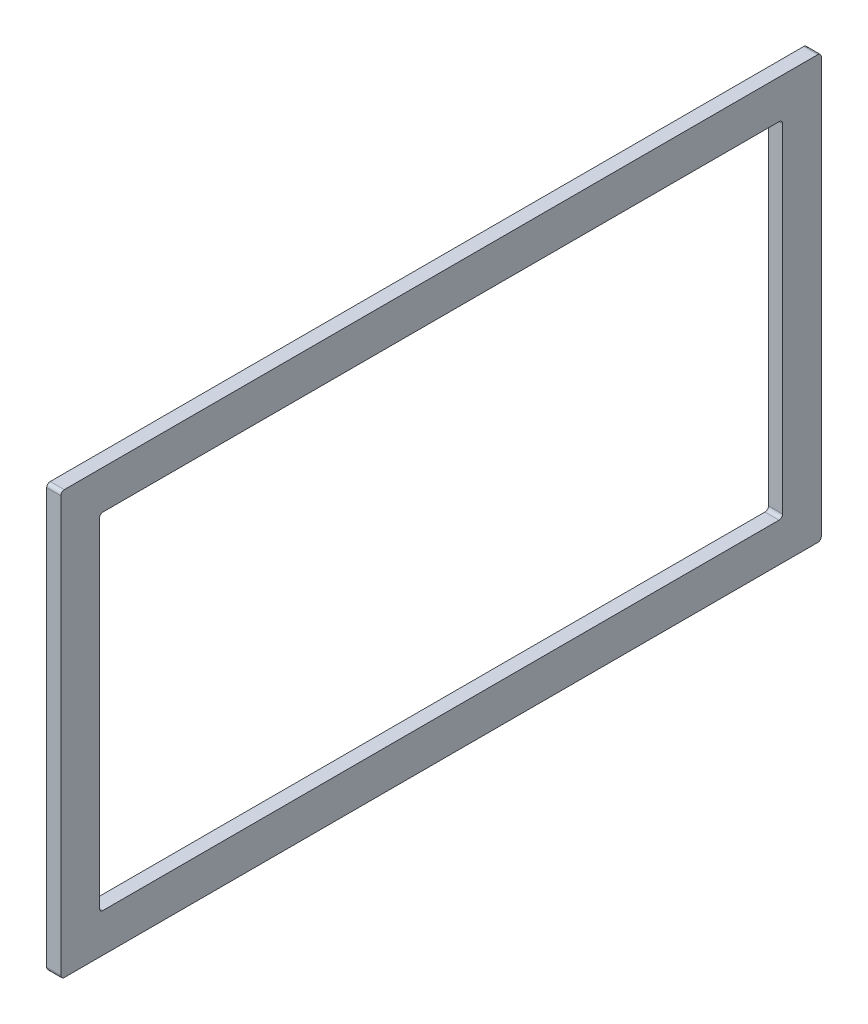
ISO-10303-21;
HEADER;
FILE_DESCRIPTION(('STEP AP214'),'2;1');
FILE_NAME('part.step','',(''),(''),'','','');
FILE_SCHEMA(('AUTOMOTIVE_DESIGN { 1 0 10303 214 1 1 1 1 }'));
ENDSEC;
DATA;
#1=APPLICATION_CONTEXT('core data for automotive mechanical design processes');
#2=APPLICATION_PROTOCOL_DEFINITION('international standard','automotive_design',2000,#1);
#3=PRODUCT_CONTEXT('',#1,'mechanical');
#4=PRODUCT('Part','Part','',(#3));
#5=PRODUCT_RELATED_PRODUCT_CATEGORY('part','',(#4));
#6=PRODUCT_DEFINITION_FORMATION('','',#4);
#7=PRODUCT_DEFINITION_CONTEXT('part definition',#1,'design');
#8=PRODUCT_DEFINITION('design','',#6,#7);
#9=PRODUCT_DEFINITION_SHAPE('','',#8);
#10=(LENGTH_UNIT() NAMED_UNIT(*) SI_UNIT(.MILLI.,.METRE.));
#11=(NAMED_UNIT(*) PLANE_ANGLE_UNIT() SI_UNIT($,.RADIAN.));
#12=(NAMED_UNIT(*) SI_UNIT($,.STERADIAN.) SOLID_ANGLE_UNIT());
#13=UNCERTAINTY_MEASURE_WITH_UNIT(LENGTH_MEASURE(1.E-05),#10,'distance_accuracy_value','');
#14=(GEOMETRIC_REPRESENTATION_CONTEXT(3) GLOBAL_UNCERTAINTY_ASSIGNED_CONTEXT((#13)) GLOBAL_UNIT_ASSIGNED_CONTEXT((#10,
#11,#12)) REPRESENTATION_CONTEXT('',''));
#15=CARTESIAN_POINT('',(0.,0.,0.));
#16=DIRECTION('',(0.,0.,1.));
#17=DIRECTION('',(1.,0.,0.));
#18=AXIS2_PLACEMENT_3D('',#15,#16,#17);
#19=CARTESIAN_POINT('',(-323.849999999993,0.,0.));
#20=DIRECTION('',(-1.,0.,0.));
#21=DIRECTION('',(0.,0.,1.));
#22=AXIS2_PLACEMENT_3D('',#19,#20,#21);
#23=PLANE('',#22);
#24=DIRECTION('',(0.,0.,-1.));
#25=VECTOR('',#24,1.);
#26=CARTESIAN_POINT('',(-323.849999999993,520.7,-342.9));
#27=LINE('',#26,#25);
#28=CARTESIAN_POINT('',(-323.849999999993,520.7,339.725));
#29=VERTEX_POINT('',#28);
#30=CARTESIAN_POINT('',(-323.849999999993,520.7,-339.725));
#31=VERTEX_POINT('',#30);
#32=EDGE_CURVE('E179',#29,#31,#27,.T.);
#33=ORIENTED_EDGE('',*,*,#32,.T.);
#34=CARTESIAN_POINT('',(-323.849999999993,517.525,-339.725));
#35=DIRECTION('',(-1.,0.,0.));
#36=DIRECTION('',(0.,0.,1.));
#37=AXIS2_PLACEMENT_3D('',#34,#35,#36);
#38=CIRCLE('',#37,3.175);
#39=CARTESIAN_POINT('',(-323.849999999993,517.525,-342.9));
#40=VERTEX_POINT('',#39);
#41=EDGE_CURVE('E226',#31,#40,#38,.T.);
#42=ORIENTED_EDGE('',*,*,#41,.T.);
#43=DIRECTION('',(0.,-1.,0.));
#44=VECTOR('',#43,1.);
#45=CARTESIAN_POINT('',(-323.849999999993,520.7,-342.9));
#46=LINE('',#45,#44);
#47=CARTESIAN_POINT('',(-323.849999999993,142.875,-342.9));
#48=VERTEX_POINT('',#47);
#49=EDGE_CURVE('E278',#40,#48,#46,.T.);
#50=ORIENTED_EDGE('',*,*,#49,.T.);
#51=CARTESIAN_POINT('',(-323.849999999993,142.875,-339.725));
#52=DIRECTION('',(-1.,0.,0.));
#53=DIRECTION('',(0.,0.,1.));
#54=AXIS2_PLACEMENT_3D('',#51,#52,#53);
#55=CIRCLE('',#54,3.175);
#56=CARTESIAN_POINT('',(-323.849999999993,139.7,-339.725));
#57=VERTEX_POINT('',#56);
#58=EDGE_CURVE('E221',#48,#57,#55,.T.);
#59=ORIENTED_EDGE('',*,*,#58,.T.);
#60=DIRECTION('',(0.,0.,1.));
#61=VECTOR('',#60,1.);
#62=CARTESIAN_POINT('',(-323.849999999993,139.7,-342.9));
#63=LINE('',#62,#61);
#64=CARTESIAN_POINT('',(-323.849999999993,139.7,339.725));
#65=VERTEX_POINT('',#64);
#66=EDGE_CURVE('E281',#57,#65,#63,.T.);
#67=ORIENTED_EDGE('',*,*,#66,.T.);
#68=CARTESIAN_POINT('',(-323.849999999993,142.875,339.725));
#69=DIRECTION('',(-1.,0.,0.));
#70=DIRECTION('',(0.,0.,1.));
#71=AXIS2_PLACEMENT_3D('',#68,#69,#70);
#72=CIRCLE('',#71,3.175);
#73=CARTESIAN_POINT('',(-323.849999999993,142.875,342.9));
#74=VERTEX_POINT('',#73);
#75=EDGE_CURVE('E61',#65,#74,#72,.T.);
#76=ORIENTED_EDGE('',*,*,#75,.T.);
#77=DIRECTION('',(0.,1.,0.));
#78=VECTOR('',#77,1.);
#79=CARTESIAN_POINT('',(-323.849999999993,520.7,342.9));
#80=LINE('',#79,#78);
#81=CARTESIAN_POINT('',(-323.849999999993,517.525,342.9));
#82=VERTEX_POINT('',#81);
#83=EDGE_CURVE('E184',#74,#82,#80,.T.);
#84=ORIENTED_EDGE('',*,*,#83,.T.);
#85=CARTESIAN_POINT('',(-323.849999999993,517.525,339.725));
#86=DIRECTION('',(-1.,0.,0.));
#87=DIRECTION('',(0.,0.,1.));
#88=AXIS2_PLACEMENT_3D('',#85,#86,#87);
#89=CIRCLE('',#88,3.175);
#90=EDGE_CURVE('E224',#82,#29,#89,.T.);
#91=ORIENTED_EDGE('',*,*,#90,.T.);
#92=EDGE_LOOP('',(#33,#42,#50,#59,#67,#76,#84,#91));
#93=FACE_BOUND('',#92,.T.);
#94=DIRECTION('',(0.,0.,1.));
#95=VECTOR('',#94,1.);
#96=CARTESIAN_POINT('',(-323.849999999993,174.625,-307.975));
#97=LINE('',#96,#95);
#98=CARTESIAN_POINT('',(-323.849999999993,174.625,-304.8));
#99=VERTEX_POINT('',#98);
#100=CARTESIAN_POINT('',(-323.849999999993,174.625,304.8));
#101=VERTEX_POINT('',#100);
#102=EDGE_CURVE('E271',#99,#101,#97,.T.);
#103=ORIENTED_EDGE('',*,*,#102,.F.);
#104=CARTESIAN_POINT('',(-323.849999999993,177.8,-304.8));
#105=DIRECTION('',(-1.,0.,0.));
#106=DIRECTION('',(0.,0.,1.));
#107=AXIS2_PLACEMENT_3D('',#104,#105,#106);
#108=CIRCLE('',#107,3.175);
#109=CARTESIAN_POINT('',(-323.849999999993,177.8,-307.975));
#110=VERTEX_POINT('',#109);
#111=EDGE_CURVE('E164',#99,#110,#108,.F.);
#112=ORIENTED_EDGE('',*,*,#111,.T.);
#113=DIRECTION('',(0.,-1.,0.));
#114=VECTOR('',#113,1.);
#115=CARTESIAN_POINT('',(-323.849999999993,485.775,-307.975));
#116=LINE('',#115,#114);
#117=CARTESIAN_POINT('',(-323.849999999993,482.6,-307.975));
#118=VERTEX_POINT('',#117);
#119=EDGE_CURVE('E260',#118,#110,#116,.T.);
#120=ORIENTED_EDGE('',*,*,#119,.F.);
#121=CARTESIAN_POINT('',(-323.849999999993,482.6,-304.8));
#122=DIRECTION('',(-1.,0.,0.));
#123=DIRECTION('',(0.,0.,1.));
#124=AXIS2_PLACEMENT_3D('',#121,#122,#123);
#125=CIRCLE('',#124,3.175);
#126=CARTESIAN_POINT('',(-323.849999999993,485.775,-304.8));
#127=VERTEX_POINT('',#126);
#128=EDGE_CURVE('E11',#118,#127,#125,.F.);
#129=ORIENTED_EDGE('',*,*,#128,.T.);
#130=DIRECTION('',(0.,0.,-1.));
#131=VECTOR('',#130,1.);
#132=CARTESIAN_POINT('',(-323.849999999993,485.775,-307.975));
#133=LINE('',#132,#131);
#134=CARTESIAN_POINT('',(-323.849999999993,485.775,304.8));
#135=VERTEX_POINT('',#134);
#136=EDGE_CURVE('E258',#135,#127,#133,.T.);
#137=ORIENTED_EDGE('',*,*,#136,.F.);
#138=CARTESIAN_POINT('',(-323.849999999993,482.6,304.8));
#139=DIRECTION('',(-1.,0.,0.));
#140=DIRECTION('',(0.,0.,1.));
#141=AXIS2_PLACEMENT_3D('',#138,#139,#140);
#142=CIRCLE('',#141,3.175);
#143=CARTESIAN_POINT('',(-323.849999999993,482.6,307.975));
#144=VERTEX_POINT('',#143);
#145=EDGE_CURVE('E165',#135,#144,#142,.F.);
#146=ORIENTED_EDGE('',*,*,#145,.T.);
#147=DIRECTION('',(0.,1.,0.));
#148=VECTOR('',#147,1.);
#149=CARTESIAN_POINT('',(-323.849999999993,485.775,307.975));
#150=LINE('',#149,#148);
#151=CARTESIAN_POINT('',(-323.849999999993,177.8,307.975));
#152=VERTEX_POINT('',#151);
#153=EDGE_CURVE('E265',#152,#144,#150,.T.);
#154=ORIENTED_EDGE('',*,*,#153,.F.);
#155=CARTESIAN_POINT('',(-323.849999999993,177.8,304.8));
#156=DIRECTION('',(-1.,0.,0.));
#157=DIRECTION('',(0.,0.,1.));
#158=AXIS2_PLACEMENT_3D('',#155,#156,#157);
#159=CIRCLE('',#158,3.175);
#160=EDGE_CURVE('E239',#152,#101,#159,.F.);
#161=ORIENTED_EDGE('',*,*,#160,.T.);
#162=EDGE_LOOP('',(#103,#112,#120,#129,#137,#146,#154,#161));
#163=FACE_BOUND('',#162,.T.);
#164=ADVANCED_FACE('F39',(#93,#163),#23,.T.);
#165=CARTESIAN_POINT('',(-311.149999999993,0.,0.));
#166=DIRECTION('',(-1.,0.,0.));
#167=DIRECTION('',(0.,0.,1.));
#168=AXIS2_PLACEMENT_3D('',#165,#166,#167);
#169=PLANE('',#168);
#170=DIRECTION('',(0.,-1.,0.));
#171=VECTOR('',#170,1.);
#172=CARTESIAN_POINT('',(-311.149999999993,520.7,-342.9));
#173=LINE('',#172,#171);
#174=CARTESIAN_POINT('',(-311.149999999993,517.525,-342.9));
#175=VERTEX_POINT('',#174);
#176=CARTESIAN_POINT('',(-311.149999999993,142.875,-342.9));
#177=VERTEX_POINT('',#176);
#178=EDGE_CURVE('E264',#175,#177,#173,.T.);
#179=ORIENTED_EDGE('',*,*,#178,.F.);
#180=CARTESIAN_POINT('',(-311.149999999993,517.525,-339.725));
#181=DIRECTION('',(-1.,0.,0.));
#182=DIRECTION('',(0.,0.,1.));
#183=AXIS2_PLACEMENT_3D('',#180,#181,#182);
#184=CIRCLE('',#183,3.175);
#185=CARTESIAN_POINT('',(-311.149999999993,520.7,-339.725));
#186=VERTEX_POINT('',#185);
#187=EDGE_CURVE('E214',#175,#186,#184,.F.);
#188=ORIENTED_EDGE('',*,*,#187,.T.);
#189=DIRECTION('',(0.,0.,-1.));
#190=VECTOR('',#189,1.);
#191=CARTESIAN_POINT('',(-311.149999999993,520.7,-342.9));
#192=LINE('',#191,#190);
#193=CARTESIAN_POINT('',(-311.149999999993,520.7,339.725));
#194=VERTEX_POINT('',#193);
#195=EDGE_CURVE('E187',#194,#186,#192,.T.);
#196=ORIENTED_EDGE('',*,*,#195,.F.);
#197=CARTESIAN_POINT('',(-311.149999999993,517.525,339.725));
#198=DIRECTION('',(-1.,0.,0.));
#199=DIRECTION('',(0.,0.,1.));
#200=AXIS2_PLACEMENT_3D('',#197,#198,#199);
#201=CIRCLE('',#200,3.175);
#202=CARTESIAN_POINT('',(-311.149999999993,517.525,342.9));
#203=VERTEX_POINT('',#202);
#204=EDGE_CURVE('E212',#194,#203,#201,.F.);
#205=ORIENTED_EDGE('',*,*,#204,.T.);
#206=DIRECTION('',(0.,1.,0.));
#207=VECTOR('',#206,1.);
#208=CARTESIAN_POINT('',(-311.149999999993,520.7,342.9));
#209=LINE('',#208,#207);
#210=CARTESIAN_POINT('',(-311.149999999993,142.875,342.9));
#211=VERTEX_POINT('',#210);
#212=EDGE_CURVE('E285',#211,#203,#209,.T.);
#213=ORIENTED_EDGE('',*,*,#212,.F.);
#214=CARTESIAN_POINT('',(-311.149999999993,142.875,339.725));
#215=DIRECTION('',(-1.,0.,0.));
#216=DIRECTION('',(0.,0.,1.));
#217=AXIS2_PLACEMENT_3D('',#214,#215,#216);
#218=CIRCLE('',#217,3.175);
#219=CARTESIAN_POINT('',(-311.149999999993,139.7,339.725));
#220=VERTEX_POINT('',#219);
#221=EDGE_CURVE('E210',#211,#220,#218,.F.);
#222=ORIENTED_EDGE('',*,*,#221,.T.);
#223=DIRECTION('',(0.,0.,1.));
#224=VECTOR('',#223,1.);
#225=CARTESIAN_POINT('',(-311.149999999993,139.7,-342.9));
#226=LINE('',#225,#224);
#227=CARTESIAN_POINT('',(-311.149999999993,139.7,-339.725));
#228=VERTEX_POINT('',#227);
#229=EDGE_CURVE('E268',#228,#220,#226,.T.);
#230=ORIENTED_EDGE('',*,*,#229,.F.);
#231=CARTESIAN_POINT('',(-311.149999999993,142.875,-339.725));
#232=DIRECTION('',(-1.,0.,0.));
#233=DIRECTION('',(0.,0.,1.));
#234=AXIS2_PLACEMENT_3D('',#231,#232,#233);
#235=CIRCLE('',#234,3.175);
#236=EDGE_CURVE('E208',#228,#177,#235,.F.);
#237=ORIENTED_EDGE('',*,*,#236,.T.);
#238=EDGE_LOOP('',(#179,#188,#196,#205,#213,#222,#230,#237));
#239=FACE_BOUND('',#238,.T.);
#240=DIRECTION('',(0.,0.,-1.));
#241=VECTOR('',#240,1.);
#242=CARTESIAN_POINT('',(-311.149999999993,485.775,-307.975));
#243=LINE('',#242,#241);
#244=CARTESIAN_POINT('',(-311.149999999993,485.775,304.8));
#245=VERTEX_POINT('',#244);
#246=CARTESIAN_POINT('',(-311.149999999993,485.775,-304.8));
#247=VERTEX_POINT('',#246);
#248=EDGE_CURVE('E245',#245,#247,#243,.T.);
#249=ORIENTED_EDGE('',*,*,#248,.T.);
#250=CARTESIAN_POINT('',(-311.149999999993,482.6,-304.8));
#251=DIRECTION('',(-1.,0.,0.));
#252=DIRECTION('',(0.,0.,1.));
#253=AXIS2_PLACEMENT_3D('',#250,#251,#252);
#254=CIRCLE('',#253,3.175);
#255=CARTESIAN_POINT('',(-311.149999999993,482.6,-307.975));
#256=VERTEX_POINT('',#255);
#257=EDGE_CURVE('E47',#247,#256,#254,.T.);
#258=ORIENTED_EDGE('',*,*,#257,.T.);
#259=DIRECTION('',(0.,-1.,0.));
#260=VECTOR('',#259,1.);
#261=CARTESIAN_POINT('',(-311.149999999993,485.775,-307.975));
#262=LINE('',#261,#260);
#263=CARTESIAN_POINT('',(-311.149999999993,177.8,-307.975));
#264=VERTEX_POINT('',#263);
#265=EDGE_CURVE('E159',#256,#264,#262,.T.);
#266=ORIENTED_EDGE('',*,*,#265,.T.);
#267=CARTESIAN_POINT('',(-311.149999999993,177.8,-304.8));
#268=DIRECTION('',(-1.,0.,0.));
#269=DIRECTION('',(0.,0.,1.));
#270=AXIS2_PLACEMENT_3D('',#267,#268,#269);
#271=CIRCLE('',#270,3.175);
#272=CARTESIAN_POINT('',(-311.149999999993,174.625,-304.8));
#273=VERTEX_POINT('',#272);
#274=EDGE_CURVE('E153',#264,#273,#271,.T.);
#275=ORIENTED_EDGE('',*,*,#274,.T.);
#276=DIRECTION('',(0.,0.,1.));
#277=VECTOR('',#276,1.);
#278=CARTESIAN_POINT('',(-311.149999999993,174.625,-307.975));
#279=LINE('',#278,#277);
#280=CARTESIAN_POINT('',(-311.149999999993,174.625,304.8));
#281=VERTEX_POINT('',#280);
#282=EDGE_CURVE('E157',#273,#281,#279,.T.);
#283=ORIENTED_EDGE('',*,*,#282,.T.);
#284=CARTESIAN_POINT('',(-311.149999999993,177.8,304.8));
#285=DIRECTION('',(-1.,0.,0.));
#286=DIRECTION('',(0.,0.,1.));
#287=AXIS2_PLACEMENT_3D('',#284,#285,#286);
#288=CIRCLE('',#287,3.175);
#289=CARTESIAN_POINT('',(-311.149999999993,177.8,307.975));
#290=VERTEX_POINT('',#289);
#291=EDGE_CURVE('E237',#281,#290,#288,.T.);
#292=ORIENTED_EDGE('',*,*,#291,.T.);
#293=DIRECTION('',(0.,1.,0.));
#294=VECTOR('',#293,1.);
#295=CARTESIAN_POINT('',(-311.149999999993,485.775,307.975));
#296=LINE('',#295,#294);
#297=CARTESIAN_POINT('',(-311.149999999993,482.6,307.975));
#298=VERTEX_POINT('',#297);
#299=EDGE_CURVE('E175',#290,#298,#296,.T.);
#300=ORIENTED_EDGE('',*,*,#299,.T.);
#301=CARTESIAN_POINT('',(-311.149999999993,482.6,304.8));
#302=DIRECTION('',(-1.,0.,0.));
#303=DIRECTION('',(0.,0.,1.));
#304=AXIS2_PLACEMENT_3D('',#301,#302,#303);
#305=CIRCLE('',#304,3.175);
#306=EDGE_CURVE('E241',#298,#245,#305,.T.);
#307=ORIENTED_EDGE('',*,*,#306,.T.);
#308=EDGE_LOOP('',(#249,#258,#266,#275,#283,#292,#300,#307));
#309=FACE_BOUND('',#308,.T.);
#310=ADVANCED_FACE('F156',(#239,#309),#169,.F.);
#311=CARTESIAN_POINT('',(-323.849999999993,520.7,-342.9));
#312=DIRECTION('',(0.,0.,1.));
#313=DIRECTION('',(1.,0.,0.));
#314=AXIS2_PLACEMENT_3D('',#311,#312,#313);
#315=PLANE('',#314);
#316=ORIENTED_EDGE('',*,*,#49,.F.);
#317=DIRECTION('',(1.,0.,0.));
#318=VECTOR('',#317,1.);
#319=CARTESIAN_POINT('',(-323.849999999993,517.525,-342.9));
#320=LINE('',#319,#318);
#321=EDGE_CURVE('E205',#40,#175,#320,.T.);
#322=ORIENTED_EDGE('',*,*,#321,.T.);
#323=ORIENTED_EDGE('',*,*,#178,.T.);
#324=DIRECTION('',(1.,0.,0.));
#325=VECTOR('',#324,1.);
#326=CARTESIAN_POINT('',(-323.849999999993,142.875,-342.9));
#327=LINE('',#326,#325);
#328=EDGE_CURVE('E203',#177,#48,#327,.F.);
#329=ORIENTED_EDGE('',*,*,#328,.T.);
#330=EDGE_LOOP('',(#316,#322,#323,#329));
#331=FACE_BOUND('',#330,.T.);
#332=ADVANCED_FACE('F302',(#331),#315,.F.);
#333=CARTESIAN_POINT('',(-323.849999999993,139.7,-342.9));
#334=DIRECTION('',(0.,1.,0.));
#335=DIRECTION('',(0.,0.,1.));
#336=AXIS2_PLACEMENT_3D('',#333,#334,#335);
#337=PLANE('',#336);
#338=ORIENTED_EDGE('',*,*,#229,.T.);
#339=DIRECTION('',(1.,0.,0.));
#340=VECTOR('',#339,1.);
#341=CARTESIAN_POINT('',(-323.849999999993,139.7,339.725));
#342=LINE('',#341,#340);
#343=EDGE_CURVE('E235',#220,#65,#342,.F.);
#344=ORIENTED_EDGE('',*,*,#343,.T.);
#345=ORIENTED_EDGE('',*,*,#66,.F.);
#346=DIRECTION('',(1.,0.,0.));
#347=VECTOR('',#346,1.);
#348=CARTESIAN_POINT('',(-323.849999999993,139.7,-339.725));
#349=LINE('',#348,#347);
#350=EDGE_CURVE('E232',#57,#228,#349,.T.);
#351=ORIENTED_EDGE('',*,*,#350,.T.);
#352=EDGE_LOOP('',(#338,#344,#345,#351));
#353=FACE_BOUND('',#352,.T.);
#354=ADVANCED_FACE('F310',(#353),#337,.F.);
#355=CARTESIAN_POINT('',(-323.849999999993,520.7,342.9));
#356=DIRECTION('',(0.,0.,-1.));
#357=DIRECTION('',(-1.,0.,0.));
#358=AXIS2_PLACEMENT_3D('',#355,#356,#357);
#359=PLANE('',#358);
#360=ORIENTED_EDGE('',*,*,#212,.T.);
#361=DIRECTION('',(1.,0.,0.));
#362=VECTOR('',#361,1.);
#363=CARTESIAN_POINT('',(-323.849999999993,517.525,342.9));
#364=LINE('',#363,#362);
#365=EDGE_CURVE('E54',#203,#82,#364,.F.);
#366=ORIENTED_EDGE('',*,*,#365,.T.);
#367=ORIENTED_EDGE('',*,*,#83,.F.);
#368=DIRECTION('',(1.,0.,0.));
#369=VECTOR('',#368,1.);
#370=CARTESIAN_POINT('',(-323.849999999993,142.875,342.9));
#371=LINE('',#370,#369);
#372=EDGE_CURVE('E228',#74,#211,#371,.T.);
#373=ORIENTED_EDGE('',*,*,#372,.T.);
#374=EDGE_LOOP('',(#360,#366,#367,#373));
#375=FACE_BOUND('',#374,.T.);
#376=ADVANCED_FACE('F316',(#375),#359,.F.);
#377=CARTESIAN_POINT('',(-323.849999999993,520.7,-342.9));
#378=DIRECTION('',(0.,-1.,0.));
#379=DIRECTION('',(0.,0.,-1.));
#380=AXIS2_PLACEMENT_3D('',#377,#378,#379);
#381=PLANE('',#380);
#382=ORIENTED_EDGE('',*,*,#195,.T.);
#383=DIRECTION('',(1.,0.,0.));
#384=VECTOR('',#383,1.);
#385=CARTESIAN_POINT('',(-323.849999999993,520.7,-339.725));
#386=LINE('',#385,#384);
#387=EDGE_CURVE('E219',#186,#31,#386,.F.);
#388=ORIENTED_EDGE('',*,*,#387,.T.);
#389=ORIENTED_EDGE('',*,*,#32,.F.);
#390=DIRECTION('',(1.,0.,0.));
#391=VECTOR('',#390,1.);
#392=CARTESIAN_POINT('',(-323.849999999993,520.7,339.725));
#393=LINE('',#392,#391);
#394=EDGE_CURVE('E216',#29,#194,#393,.T.);
#395=ORIENTED_EDGE('',*,*,#394,.T.);
#396=EDGE_LOOP('',(#382,#388,#389,#395));
#397=FACE_BOUND('',#396,.T.);
#398=ADVANCED_FACE('F291',(#397),#381,.F.);
#399=CARTESIAN_POINT('',(-323.849999999993,485.775,-307.975));
#400=DIRECTION('',(0.,0.,1.));
#401=DIRECTION('',(1.,0.,0.));
#402=AXIS2_PLACEMENT_3D('',#399,#400,#401);
#403=PLANE('',#402);
#404=ORIENTED_EDGE('',*,*,#119,.T.);
#405=DIRECTION('',(1.,0.,0.));
#406=VECTOR('',#405,1.);
#407=CARTESIAN_POINT('',(-311.149999999993,177.8,-307.975));
#408=LINE('',#407,#406);
#409=EDGE_CURVE('E201',#110,#264,#408,.T.);
#410=ORIENTED_EDGE('',*,*,#409,.T.);
#411=ORIENTED_EDGE('',*,*,#265,.F.);
#412=DIRECTION('',(1.,0.,0.));
#413=VECTOR('',#412,1.);
#414=CARTESIAN_POINT('',(-323.849999999993,482.6,-307.975));
#415=LINE('',#414,#413);
#416=EDGE_CURVE('E199',#256,#118,#415,.F.);
#417=ORIENTED_EDGE('',*,*,#416,.T.);
#418=EDGE_LOOP('',(#404,#410,#411,#417));
#419=FACE_BOUND('',#418,.T.);
#420=ADVANCED_FACE('F251',(#419),#403,.T.);
#421=CARTESIAN_POINT('',(-323.849999999993,174.625,-307.975));
#422=DIRECTION('',(0.,1.,0.));
#423=DIRECTION('',(0.,0.,1.));
#424=AXIS2_PLACEMENT_3D('',#421,#422,#423);
#425=PLANE('',#424);
#426=ORIENTED_EDGE('',*,*,#102,.T.);
#427=DIRECTION('',(1.,0.,0.));
#428=VECTOR('',#427,1.);
#429=CARTESIAN_POINT('',(-311.149999999993,174.625,304.8));
#430=LINE('',#429,#428);
#431=EDGE_CURVE('E174',#101,#281,#430,.T.);
#432=ORIENTED_EDGE('',*,*,#431,.T.);
#433=ORIENTED_EDGE('',*,*,#282,.F.);
#434=DIRECTION('',(1.,0.,0.));
#435=VECTOR('',#434,1.);
#436=CARTESIAN_POINT('',(-323.849999999993,174.625,-304.8));
#437=LINE('',#436,#435);
#438=EDGE_CURVE('E171',#273,#99,#437,.F.);
#439=ORIENTED_EDGE('',*,*,#438,.T.);
#440=EDGE_LOOP('',(#426,#432,#433,#439));
#441=FACE_BOUND('',#440,.T.);
#442=ADVANCED_FACE('F170',(#441),#425,.T.);
#443=CARTESIAN_POINT('',(-323.849999999993,485.775,307.975));
#444=DIRECTION('',(0.,0.,-1.));
#445=DIRECTION('',(-1.,0.,0.));
#446=AXIS2_PLACEMENT_3D('',#443,#444,#445);
#447=PLANE('',#446);
#448=ORIENTED_EDGE('',*,*,#299,.F.);
#449=DIRECTION('',(1.,0.,0.));
#450=VECTOR('',#449,1.);
#451=CARTESIAN_POINT('',(-323.849999999993,177.8,307.975));
#452=LINE('',#451,#450);
#453=EDGE_CURVE('E192',#290,#152,#452,.F.);
#454=ORIENTED_EDGE('',*,*,#453,.T.);
#455=ORIENTED_EDGE('',*,*,#153,.T.);
#456=DIRECTION('',(1.,0.,0.));
#457=VECTOR('',#456,1.);
#458=CARTESIAN_POINT('',(-311.149999999993,482.6,307.975));
#459=LINE('',#458,#457);
#460=EDGE_CURVE('E181',#144,#298,#459,.T.);
#461=ORIENTED_EDGE('',*,*,#460,.T.);
#462=EDGE_LOOP('',(#448,#454,#455,#461));
#463=FACE_BOUND('',#462,.T.);
#464=ADVANCED_FACE('F406',(#463),#447,.T.);
#465=CARTESIAN_POINT('',(-323.849999999993,485.775,-307.975));
#466=DIRECTION('',(0.,-1.,0.));
#467=DIRECTION('',(0.,0.,-1.));
#468=AXIS2_PLACEMENT_3D('',#465,#466,#467);
#469=PLANE('',#468);
#470=ORIENTED_EDGE('',*,*,#248,.F.);
#471=DIRECTION('',(1.,0.,0.));
#472=VECTOR('',#471,1.);
#473=CARTESIAN_POINT('',(-323.849999999993,485.775,304.8));
#474=LINE('',#473,#472);
#475=EDGE_CURVE('E197',#245,#135,#474,.F.);
#476=ORIENTED_EDGE('',*,*,#475,.T.);
#477=ORIENTED_EDGE('',*,*,#136,.T.);
#478=DIRECTION('',(1.,0.,0.));
#479=VECTOR('',#478,1.);
#480=CARTESIAN_POINT('',(-311.149999999993,485.775,-304.8));
#481=LINE('',#480,#479);
#482=EDGE_CURVE('E194',#127,#247,#481,.T.);
#483=ORIENTED_EDGE('',*,*,#482,.T.);
#484=EDGE_LOOP('',(#470,#476,#477,#483));
#485=FACE_BOUND('',#484,.T.);
#486=ADVANCED_FACE('F262',(#485),#469,.T.);
#487=CARTESIAN_POINT('',(-323.849999999993,177.8,304.8));
#488=DIRECTION('',(-1.,0.,0.));
#489=DIRECTION('',(0.,0.,1.));
#490=AXIS2_PLACEMENT_3D('',#487,#488,#489);
#491=CYLINDRICAL_SURFACE('',#490,3.175);
#492=ORIENTED_EDGE('',*,*,#160,.F.);
#493=ORIENTED_EDGE('',*,*,#453,.F.);
#494=ORIENTED_EDGE('',*,*,#291,.F.);
#495=ORIENTED_EDGE('',*,*,#431,.F.);
#496=EDGE_LOOP('',(#492,#493,#494,#495));
#497=FACE_BOUND('',#496,.T.);
#498=ADVANCED_FACE('F345',(#497),#491,.F.);
#499=CARTESIAN_POINT('',(-323.849999999993,482.6,304.8));
#500=DIRECTION('',(-1.,0.,0.));
#501=DIRECTION('',(0.,0.,1.));
#502=AXIS2_PLACEMENT_3D('',#499,#500,#501);
#503=CYLINDRICAL_SURFACE('',#502,3.175);
#504=ORIENTED_EDGE('',*,*,#145,.F.);
#505=ORIENTED_EDGE('',*,*,#475,.F.);
#506=ORIENTED_EDGE('',*,*,#306,.F.);
#507=ORIENTED_EDGE('',*,*,#460,.F.);
#508=EDGE_LOOP('',(#504,#505,#506,#507));
#509=FACE_BOUND('',#508,.T.);
#510=ADVANCED_FACE('F348',(#509),#503,.F.);
#511=CARTESIAN_POINT('',(-323.849999999993,177.8,-304.8));
#512=DIRECTION('',(-1.,0.,0.));
#513=DIRECTION('',(0.,0.,1.));
#514=AXIS2_PLACEMENT_3D('',#511,#512,#513);
#515=CYLINDRICAL_SURFACE('',#514,3.175);
#516=ORIENTED_EDGE('',*,*,#111,.F.);
#517=ORIENTED_EDGE('',*,*,#438,.F.);
#518=ORIENTED_EDGE('',*,*,#274,.F.);
#519=ORIENTED_EDGE('',*,*,#409,.F.);
#520=EDGE_LOOP('',(#516,#517,#518,#519));
#521=FACE_BOUND('',#520,.T.);
#522=ADVANCED_FACE('F178',(#521),#515,.F.);
#523=CARTESIAN_POINT('',(-323.849999999993,517.525,-339.725));
#524=DIRECTION('',(1.,0.,0.));
#525=DIRECTION('',(0.,0.,-1.));
#526=AXIS2_PLACEMENT_3D('',#523,#524,#525);
#527=CYLINDRICAL_SURFACE('',#526,3.175);
#528=ORIENTED_EDGE('',*,*,#41,.F.);
#529=ORIENTED_EDGE('',*,*,#387,.F.);
#530=ORIENTED_EDGE('',*,*,#187,.F.);
#531=ORIENTED_EDGE('',*,*,#321,.F.);
#532=EDGE_LOOP('',(#528,#529,#530,#531));
#533=FACE_BOUND('',#532,.T.);
#534=ADVANCED_FACE('F297',(#533),#527,.T.);
#535=CARTESIAN_POINT('',(-323.849999999993,517.525,339.725));
#536=DIRECTION('',(1.,0.,0.));
#537=DIRECTION('',(0.,0.,-1.));
#538=AXIS2_PLACEMENT_3D('',#535,#536,#537);
#539=CYLINDRICAL_SURFACE('',#538,3.175);
#540=ORIENTED_EDGE('',*,*,#90,.F.);
#541=ORIENTED_EDGE('',*,*,#365,.F.);
#542=ORIENTED_EDGE('',*,*,#204,.F.);
#543=ORIENTED_EDGE('',*,*,#394,.F.);
#544=EDGE_LOOP('',(#540,#541,#542,#543));
#545=FACE_BOUND('',#544,.T.);
#546=ADVANCED_FACE('F319',(#545),#539,.T.);
#547=CARTESIAN_POINT('',(-323.849999999993,142.875,339.725));
#548=DIRECTION('',(1.,0.,0.));
#549=DIRECTION('',(0.,0.,-1.));
#550=AXIS2_PLACEMENT_3D('',#547,#548,#549);
#551=CYLINDRICAL_SURFACE('',#550,3.175);
#552=ORIENTED_EDGE('',*,*,#75,.F.);
#553=ORIENTED_EDGE('',*,*,#343,.F.);
#554=ORIENTED_EDGE('',*,*,#221,.F.);
#555=ORIENTED_EDGE('',*,*,#372,.F.);
#556=EDGE_LOOP('',(#552,#553,#554,#555));
#557=FACE_BOUND('',#556,.T.);
#558=ADVANCED_FACE('F314',(#557),#551,.T.);
#559=CARTESIAN_POINT('',(-323.849999999993,142.875,-339.725));
#560=DIRECTION('',(1.,0.,0.));
#561=DIRECTION('',(0.,0.,-1.));
#562=AXIS2_PLACEMENT_3D('',#559,#560,#561);
#563=CYLINDRICAL_SURFACE('',#562,3.175);
#564=ORIENTED_EDGE('',*,*,#58,.F.);
#565=ORIENTED_EDGE('',*,*,#328,.F.);
#566=ORIENTED_EDGE('',*,*,#236,.F.);
#567=ORIENTED_EDGE('',*,*,#350,.F.);
#568=EDGE_LOOP('',(#564,#565,#566,#567));
#569=FACE_BOUND('',#568,.T.);
#570=ADVANCED_FACE('F306',(#569),#563,.T.);
#571=CARTESIAN_POINT('',(-323.849999999993,482.6,-304.8));
#572=DIRECTION('',(-1.,0.,0.));
#573=DIRECTION('',(0.,0.,1.));
#574=AXIS2_PLACEMENT_3D('',#571,#572,#573);
#575=CYLINDRICAL_SURFACE('',#574,3.175);
#576=ORIENTED_EDGE('',*,*,#128,.F.);
#577=ORIENTED_EDGE('',*,*,#416,.F.);
#578=ORIENTED_EDGE('',*,*,#257,.F.);
#579=ORIENTED_EDGE('',*,*,#482,.F.);
#580=EDGE_LOOP('',(#576,#577,#578,#579));
#581=FACE_BOUND('',#580,.T.);
#582=ADVANCED_FACE('F41',(#581),#575,.F.);
#583=CLOSED_SHELL('',(#164,#310,#332,#354,#376,#398,#420,#442,#464,#486,#498,#510,#522,#534,
#546,#558,#570,#582));
#584=MANIFOLD_SOLID_BREP('B2',#583);
#585=ADVANCED_BREP_SHAPE_REPRESENTATION('',(#18,#584),#14);
#586=SHAPE_DEFINITION_REPRESENTATION(#9,#585);
ENDSEC;
END-ISO-10303-21;
